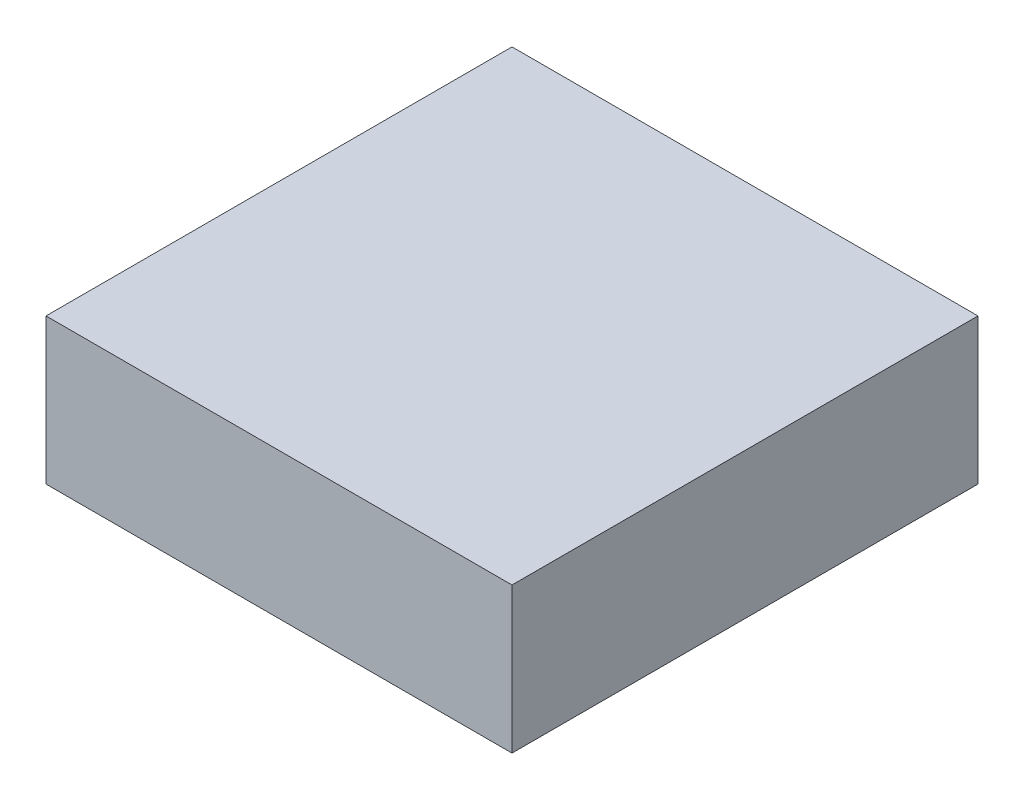
ISO-10303-21;
HEADER;
FILE_DESCRIPTION(('STEP AP214'),'2;1');
FILE_NAME('part.step','',(''),(''),'','','');
FILE_SCHEMA(('AUTOMOTIVE_DESIGN { 1 0 10303 214 1 1 1 1 }'));
ENDSEC;
DATA;
#1=APPLICATION_CONTEXT('core data for automotive mechanical design processes');
#2=APPLICATION_PROTOCOL_DEFINITION('international standard','automotive_design',2000,#1);
#3=PRODUCT_CONTEXT('',#1,'mechanical');
#4=PRODUCT('Part','Part','',(#3));
#5=PRODUCT_RELATED_PRODUCT_CATEGORY('part','',(#4));
#6=PRODUCT_DEFINITION_FORMATION('','',#4);
#7=PRODUCT_DEFINITION_CONTEXT('part definition',#1,'design');
#8=PRODUCT_DEFINITION('design','',#6,#7);
#9=PRODUCT_DEFINITION_SHAPE('','',#8);
#10=(LENGTH_UNIT() NAMED_UNIT(*) SI_UNIT(.MILLI.,.METRE.));
#11=(NAMED_UNIT(*) PLANE_ANGLE_UNIT() SI_UNIT($,.RADIAN.));
#12=(NAMED_UNIT(*) SI_UNIT($,.STERADIAN.) SOLID_ANGLE_UNIT());
#13=UNCERTAINTY_MEASURE_WITH_UNIT(LENGTH_MEASURE(1.E-05),#10,'distance_accuracy_value','');
#14=(GEOMETRIC_REPRESENTATION_CONTEXT(3) GLOBAL_UNCERTAINTY_ASSIGNED_CONTEXT((#13)) GLOBAL_UNIT_ASSIGNED_CONTEXT((#10,
#11,#12)) REPRESENTATION_CONTEXT('',''));
#15=CARTESIAN_POINT('',(0.,0.,0.));
#16=DIRECTION('',(0.,0.,1.));
#17=DIRECTION('',(1.,0.,0.));
#18=AXIS2_PLACEMENT_3D('',#15,#16,#17);
#19=CARTESIAN_POINT('',(-0.7999984,-0.2499995,0.));
#20=DIRECTION('',(0.,1.,0.));
#21=DIRECTION('',(0.,0.,1.));
#22=AXIS2_PLACEMENT_3D('',#19,#20,#21);
#23=PLANE('',#22);
#24=DIRECTION('',(0.,0.,1.));
#25=VECTOR('',#24,1.);
#26=CARTESIAN_POINT('',(0.80000094,-0.2499995,0.));
#27=LINE('',#26,#25);
#28=CARTESIAN_POINT('',(0.80000094,-0.2499995,0.));
#29=VERTEX_POINT('',#28);
#30=CARTESIAN_POINT('',(0.80000094,-0.2499995,1.59999934));
#31=VERTEX_POINT('',#30);
#32=EDGE_CURVE('E20',#29,#31,#27,.T.);
#33=ORIENTED_EDGE('',*,*,#32,.T.);
#34=DIRECTION('',(-1.,0.,0.));
#35=VECTOR('',#34,1.);
#36=CARTESIAN_POINT('',(0.80000094,-0.2499995,1.59999934));
#37=LINE('',#36,#35);
#38=CARTESIAN_POINT('',(-0.7999984,-0.2499995,1.59999934));
#39=VERTEX_POINT('',#38);
#40=EDGE_CURVE('E55',#31,#39,#37,.T.);
#41=ORIENTED_EDGE('',*,*,#40,.T.);
#42=DIRECTION('',(0.,0.,-1.));
#43=VECTOR('',#42,1.);
#44=CARTESIAN_POINT('',(-0.7999984,-0.2499995,0.));
#45=LINE('',#44,#43);
#46=CARTESIAN_POINT('',(-0.7999984,-0.2499995,0.));
#47=VERTEX_POINT('',#46);
#48=EDGE_CURVE('E76',#39,#47,#45,.T.);
#49=ORIENTED_EDGE('',*,*,#48,.T.);
#50=DIRECTION('',(-1.,0.,0.));
#51=VECTOR('',#50,1.);
#52=CARTESIAN_POINT('',(0.80000094,-0.2499995,0.));
#53=LINE('',#52,#51);
#54=EDGE_CURVE('E58',#29,#47,#53,.T.);
#55=ORIENTED_EDGE('',*,*,#54,.F.);
#56=EDGE_LOOP('',(#33,#41,#49,#55));
#57=FACE_BOUND('',#56,.T.);
#58=ADVANCED_FACE('F17',(#57),#23,.F.);
#59=CARTESIAN_POINT('',(0.80000094,-0.2499995,0.));
#60=DIRECTION('',(-1.,0.,0.));
#61=DIRECTION('',(0.,0.,1.));
#62=AXIS2_PLACEMENT_3D('',#59,#60,#61);
#63=PLANE('',#62);
#64=DIRECTION('',(0.,0.,-1.));
#65=VECTOR('',#64,1.);
#66=CARTESIAN_POINT('',(0.80000094,0.25000204,0.));
#67=LINE('',#66,#65);
#68=CARTESIAN_POINT('',(0.80000094,0.25000204,0.));
#69=VERTEX_POINT('',#68);
#70=CARTESIAN_POINT('',(0.80000094,0.25000204,1.59999934));
#71=VERTEX_POINT('',#70);
#72=EDGE_CURVE('E73',#69,#71,#67,.F.);
#73=ORIENTED_EDGE('',*,*,#72,.T.);
#74=DIRECTION('',(0.,1.,0.));
#75=VECTOR('',#74,1.);
#76=CARTESIAN_POINT('',(0.80000094,0.25000204,1.59999934));
#77=LINE('',#76,#75);
#78=EDGE_CURVE('E63',#71,#31,#77,.F.);
#79=ORIENTED_EDGE('',*,*,#78,.T.);
#80=ORIENTED_EDGE('',*,*,#32,.F.);
#81=DIRECTION('',(0.,1.,0.));
#82=VECTOR('',#81,1.);
#83=CARTESIAN_POINT('',(0.80000094,0.25000204,0.));
#84=LINE('',#83,#82);
#85=EDGE_CURVE('E78',#69,#29,#84,.F.);
#86=ORIENTED_EDGE('',*,*,#85,.F.);
#87=EDGE_LOOP('',(#73,#79,#80,#86));
#88=FACE_BOUND('',#87,.T.);
#89=ADVANCED_FACE('F72',(#88),#63,.F.);
#90=CARTESIAN_POINT('',(0.80000094,0.25000204,1.59999934));
#91=DIRECTION('',(0.,0.,-1.));
#92=DIRECTION('',(-1.,0.,0.));
#93=AXIS2_PLACEMENT_3D('',#90,#91,#92);
#94=PLANE('',#93);
#95=DIRECTION('',(0.,1.,0.));
#96=VECTOR('',#95,1.);
#97=CARTESIAN_POINT('',(-0.7999984,0.25000204,1.59999934));
#98=LINE('',#97,#96);
#99=CARTESIAN_POINT('',(-0.7999984,0.25000204,1.59999934));
#100=VERTEX_POINT('',#99);
#101=EDGE_CURVE('E69',#100,#39,#98,.F.);
#102=ORIENTED_EDGE('',*,*,#101,.T.);
#103=ORIENTED_EDGE('',*,*,#40,.F.);
#104=ORIENTED_EDGE('',*,*,#78,.F.);
#105=DIRECTION('',(1.,0.,0.));
#106=VECTOR('',#105,1.);
#107=CARTESIAN_POINT('',(0.80000094,0.25000204,1.59999934));
#108=LINE('',#107,#106);
#109=EDGE_CURVE('E83',#71,#100,#108,.F.);
#110=ORIENTED_EDGE('',*,*,#109,.T.);
#111=EDGE_LOOP('',(#102,#103,#104,#110));
#112=FACE_BOUND('',#111,.T.);
#113=ADVANCED_FACE('F66',(#112),#94,.F.);
#114=CARTESIAN_POINT('',(-0.7999984,0.25000204,0.));
#115=DIRECTION('',(1.,0.,0.));
#116=DIRECTION('',(0.,0.,-1.));
#117=AXIS2_PLACEMENT_3D('',#114,#115,#116);
#118=PLANE('',#117);
#119=ORIENTED_EDGE('',*,*,#48,.F.);
#120=ORIENTED_EDGE('',*,*,#101,.F.);
#121=DIRECTION('',(0.,0.,-1.));
#122=VECTOR('',#121,1.);
#123=CARTESIAN_POINT('',(-0.7999984,0.25000204,0.));
#124=LINE('',#123,#122);
#125=CARTESIAN_POINT('',(-0.7999984,0.25000204,0.));
#126=VERTEX_POINT('',#125);
#127=EDGE_CURVE('E26',#100,#126,#124,.T.);
#128=ORIENTED_EDGE('',*,*,#127,.T.);
#129=DIRECTION('',(0.,1.,0.));
#130=VECTOR('',#129,1.);
#131=CARTESIAN_POINT('',(-0.7999984,0.25000204,0.));
#132=LINE('',#131,#130);
#133=EDGE_CURVE('E34',#47,#126,#132,.T.);
#134=ORIENTED_EDGE('',*,*,#133,.F.);
#135=EDGE_LOOP('',(#119,#120,#128,#134));
#136=FACE_BOUND('',#135,.T.);
#137=ADVANCED_FACE('F88',(#136),#118,.F.);
#138=CARTESIAN_POINT('',(0.80000094,0.25000204,0.));
#139=DIRECTION('',(0.,0.,-1.));
#140=DIRECTION('',(-1.,0.,0.));
#141=AXIS2_PLACEMENT_3D('',#138,#139,#140);
#142=PLANE('',#141);
#143=ORIENTED_EDGE('',*,*,#133,.T.);
#144=DIRECTION('',(1.,0.,0.));
#145=VECTOR('',#144,1.);
#146=CARTESIAN_POINT('',(0.80000094,0.25000204,0.));
#147=LINE('',#146,#145);
#148=EDGE_CURVE('E11',#126,#69,#147,.T.);
#149=ORIENTED_EDGE('',*,*,#148,.T.);
#150=ORIENTED_EDGE('',*,*,#85,.T.);
#151=ORIENTED_EDGE('',*,*,#54,.T.);
#152=EDGE_LOOP('',(#143,#149,#150,#151));
#153=FACE_BOUND('',#152,.T.);
#154=ADVANCED_FACE('F91',(#153),#142,.T.);
#155=CARTESIAN_POINT('',(0.80000094,0.25000204,0.));
#156=DIRECTION('',(0.,-1.,0.));
#157=DIRECTION('',(0.,0.,-1.));
#158=AXIS2_PLACEMENT_3D('',#155,#156,#157);
#159=PLANE('',#158);
#160=ORIENTED_EDGE('',*,*,#127,.F.);
#161=ORIENTED_EDGE('',*,*,#109,.F.);
#162=ORIENTED_EDGE('',*,*,#72,.F.);
#163=ORIENTED_EDGE('',*,*,#148,.F.);
#164=EDGE_LOOP('',(#160,#161,#162,#163));
#165=FACE_BOUND('',#164,.T.);
#166=ADVANCED_FACE('F90',(#165),#159,.F.);
#167=CLOSED_SHELL('',(#58,#89,#113,#137,#154,#166));
#168=MANIFOLD_SOLID_BREP('B1',#167);
#169=ADVANCED_BREP_SHAPE_REPRESENTATION('',(#18,#168),#14);
#170=SHAPE_DEFINITION_REPRESENTATION(#9,#169);
ENDSEC;
END-ISO-10303-21;
